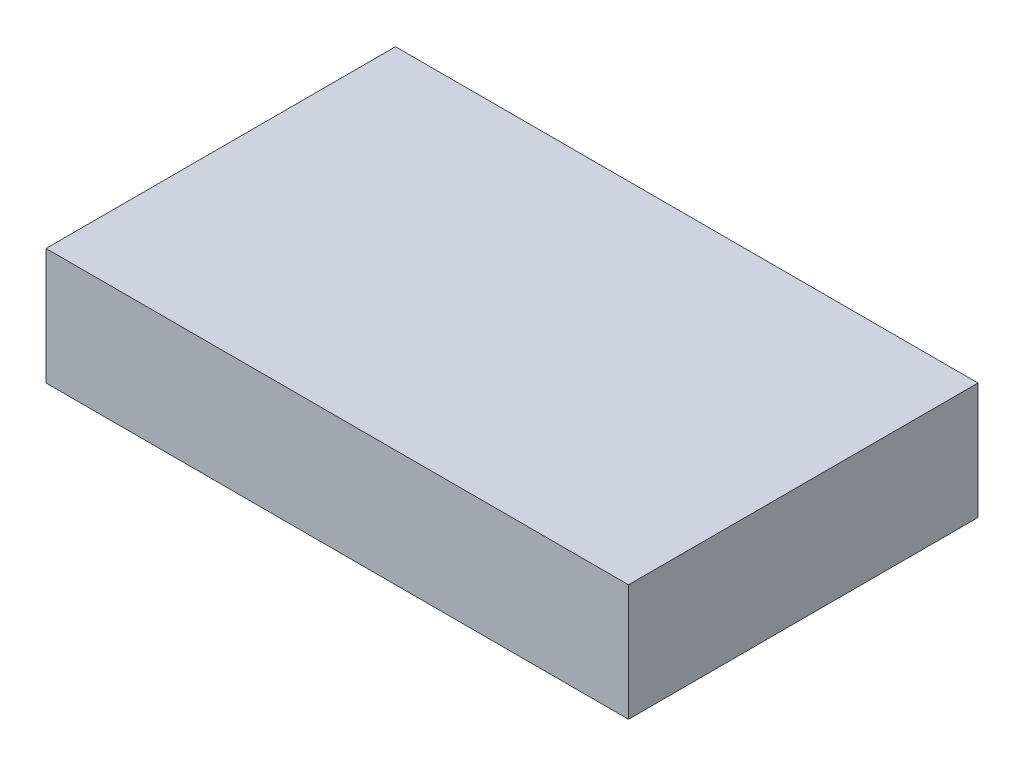
ISO-10303-21;
HEADER;
FILE_DESCRIPTION(('STEP AP214'),'2;1');
FILE_NAME('part.step','',(''),(''),'','','');
FILE_SCHEMA(('AUTOMOTIVE_DESIGN { 1 0 10303 214 1 1 1 1 }'));
ENDSEC;
DATA;
#1=APPLICATION_CONTEXT('core data for automotive mechanical design processes');
#2=APPLICATION_PROTOCOL_DEFINITION('international standard','automotive_design',2000,#1);
#3=PRODUCT_CONTEXT('',#1,'mechanical');
#4=PRODUCT('Part','Part','',(#3));
#5=PRODUCT_RELATED_PRODUCT_CATEGORY('part','',(#4));
#6=PRODUCT_DEFINITION_FORMATION('','',#4);
#7=PRODUCT_DEFINITION_CONTEXT('part definition',#1,'design');
#8=PRODUCT_DEFINITION('design','',#6,#7);
#9=PRODUCT_DEFINITION_SHAPE('','',#8);
#10=(LENGTH_UNIT() NAMED_UNIT(*) SI_UNIT(.MILLI.,.METRE.));
#11=(NAMED_UNIT(*) PLANE_ANGLE_UNIT() SI_UNIT($,.RADIAN.));
#12=(NAMED_UNIT(*) SI_UNIT($,.STERADIAN.) SOLID_ANGLE_UNIT());
#13=UNCERTAINTY_MEASURE_WITH_UNIT(LENGTH_MEASURE(1.E-05),#10,'distance_accuracy_value','');
#14=(GEOMETRIC_REPRESENTATION_CONTEXT(3) GLOBAL_UNCERTAINTY_ASSIGNED_CONTEXT((#13)) GLOBAL_UNIT_ASSIGNED_CONTEXT((#10,
#11,#12)) REPRESENTATION_CONTEXT('',''));
#15=CARTESIAN_POINT('',(0.,0.,0.));
#16=DIRECTION('',(0.,0.,1.));
#17=DIRECTION('',(1.,0.,0.));
#18=AXIS2_PLACEMENT_3D('',#15,#16,#17);
#19=CARTESIAN_POINT('',(0.,0.,57.15));
#20=DIRECTION('',(1.,0.,0.));
#21=DIRECTION('',(0.,0.,-1.));
#22=AXIS2_PLACEMENT_3D('',#19,#20,#21);
#23=PLANE('',#22);
#24=DIRECTION('',(0.,-1.,0.));
#25=VECTOR('',#24,1.);
#26=CARTESIAN_POINT('',(0.,0.,0.));
#27=LINE('',#26,#25);
#28=CARTESIAN_POINT('',(0.,19.05,0.));
#29=VERTEX_POINT('',#28);
#30=CARTESIAN_POINT('',(0.,0.,0.));
#31=VERTEX_POINT('',#30);
#32=EDGE_CURVE('E113',#29,#31,#27,.T.);
#33=ORIENTED_EDGE('',*,*,#32,.T.);
#34=DIRECTION('',(0.,0.,-1.));
#35=VECTOR('',#34,1.);
#36=CARTESIAN_POINT('',(0.,0.,57.15));
#37=LINE('',#36,#35);
#38=CARTESIAN_POINT('',(0.,0.,57.15));
#39=VERTEX_POINT('',#38);
#40=EDGE_CURVE('E11',#39,#31,#37,.T.);
#41=ORIENTED_EDGE('',*,*,#40,.F.);
#42=DIRECTION('',(0.,-1.,0.));
#43=VECTOR('',#42,1.);
#44=CARTESIAN_POINT('',(0.,0.,57.15));
#45=LINE('',#44,#43);
#46=CARTESIAN_POINT('',(0.,19.05,57.15));
#47=VERTEX_POINT('',#46);
#48=EDGE_CURVE('E97',#47,#39,#45,.T.);
#49=ORIENTED_EDGE('',*,*,#48,.F.);
#50=DIRECTION('',(0.,0.,-1.));
#51=VECTOR('',#50,1.);
#52=CARTESIAN_POINT('',(0.,19.05,57.15));
#53=LINE('',#52,#51);
#54=EDGE_CURVE('E109',#47,#29,#53,.T.);
#55=ORIENTED_EDGE('',*,*,#54,.T.);
#56=EDGE_LOOP('',(#33,#41,#49,#55));
#57=FACE_BOUND('',#56,.T.);
#58=ADVANCED_FACE('F45',(#57),#23,.F.);
#59=CARTESIAN_POINT('',(0.,0.,57.15));
#60=DIRECTION('',(0.,1.,0.));
#61=DIRECTION('',(0.,0.,1.));
#62=AXIS2_PLACEMENT_3D('',#59,#60,#61);
#63=PLANE('',#62);
#64=DIRECTION('',(1.,0.,0.));
#65=VECTOR('',#64,1.);
#66=CARTESIAN_POINT('',(0.,0.,0.));
#67=LINE('',#66,#65);
#68=CARTESIAN_POINT('',(95.25,0.,0.));
#69=VERTEX_POINT('',#68);
#70=EDGE_CURVE('E102',#31,#69,#67,.T.);
#71=ORIENTED_EDGE('',*,*,#70,.T.);
#72=DIRECTION('',(0.,0.,-1.));
#73=VECTOR('',#72,1.);
#74=CARTESIAN_POINT('',(95.25,0.,57.15));
#75=LINE('',#74,#73);
#76=CARTESIAN_POINT('',(95.25,0.,57.15));
#77=VERTEX_POINT('',#76);
#78=EDGE_CURVE('E54',#77,#69,#75,.T.);
#79=ORIENTED_EDGE('',*,*,#78,.F.);
#80=DIRECTION('',(1.,0.,0.));
#81=VECTOR('',#80,1.);
#82=CARTESIAN_POINT('',(0.,0.,57.15));
#83=LINE('',#82,#81);
#84=EDGE_CURVE('E92',#39,#77,#83,.T.);
#85=ORIENTED_EDGE('',*,*,#84,.F.);
#86=ORIENTED_EDGE('',*,*,#40,.T.);
#87=EDGE_LOOP('',(#71,#79,#85,#86));
#88=FACE_BOUND('',#87,.T.);
#89=ADVANCED_FACE('F101',(#88),#63,.F.);
#90=CARTESIAN_POINT('',(95.25,0.,57.15));
#91=DIRECTION('',(-1.,0.,0.));
#92=DIRECTION('',(0.,0.,1.));
#93=AXIS2_PLACEMENT_3D('',#90,#91,#92);
#94=PLANE('',#93);
#95=DIRECTION('',(0.,1.,0.));
#96=VECTOR('',#95,1.);
#97=CARTESIAN_POINT('',(95.25,0.,0.));
#98=LINE('',#97,#96);
#99=CARTESIAN_POINT('',(95.25,19.05,0.));
#100=VERTEX_POINT('',#99);
#101=EDGE_CURVE('E79',#69,#100,#98,.T.);
#102=ORIENTED_EDGE('',*,*,#101,.T.);
#103=DIRECTION('',(0.,0.,-1.));
#104=VECTOR('',#103,1.);
#105=CARTESIAN_POINT('',(95.25,19.05,57.15));
#106=LINE('',#105,#104);
#107=CARTESIAN_POINT('',(95.25,19.05,57.15));
#108=VERTEX_POINT('',#107);
#109=EDGE_CURVE('E104',#108,#100,#106,.T.);
#110=ORIENTED_EDGE('',*,*,#109,.F.);
#111=DIRECTION('',(0.,1.,0.));
#112=VECTOR('',#111,1.);
#113=CARTESIAN_POINT('',(95.25,0.,57.15));
#114=LINE('',#113,#112);
#115=EDGE_CURVE('E95',#77,#108,#114,.T.);
#116=ORIENTED_EDGE('',*,*,#115,.F.);
#117=ORIENTED_EDGE('',*,*,#78,.T.);
#118=EDGE_LOOP('',(#102,#110,#116,#117));
#119=FACE_BOUND('',#118,.T.);
#120=ADVANCED_FACE('F105',(#119),#94,.F.);
#121=CARTESIAN_POINT('',(0.,19.05,57.15));
#122=DIRECTION('',(0.,-1.,0.));
#123=DIRECTION('',(0.,0.,-1.));
#124=AXIS2_PLACEMENT_3D('',#121,#122,#123);
#125=PLANE('',#124);
#126=DIRECTION('',(-1.,0.,0.));
#127=VECTOR('',#126,1.);
#128=CARTESIAN_POINT('',(0.,19.05,0.));
#129=LINE('',#128,#127);
#130=EDGE_CURVE('E85',#100,#29,#129,.T.);
#131=ORIENTED_EDGE('',*,*,#130,.T.);
#132=ORIENTED_EDGE('',*,*,#54,.F.);
#133=DIRECTION('',(-1.,0.,0.));
#134=VECTOR('',#133,1.);
#135=CARTESIAN_POINT('',(0.,19.05,57.15));
#136=LINE('',#135,#134);
#137=EDGE_CURVE('E62',#108,#47,#136,.T.);
#138=ORIENTED_EDGE('',*,*,#137,.F.);
#139=ORIENTED_EDGE('',*,*,#109,.T.);
#140=EDGE_LOOP('',(#131,#132,#138,#139));
#141=FACE_BOUND('',#140,.T.);
#142=ADVANCED_FACE('F126',(#141),#125,.F.);
#143=CARTESIAN_POINT('',(0.,0.,57.15));
#144=DIRECTION('',(0.,0.,-1.));
#145=DIRECTION('',(-1.,0.,0.));
#146=AXIS2_PLACEMENT_3D('',#143,#144,#145);
#147=PLANE('',#146);
#148=ORIENTED_EDGE('',*,*,#48,.T.);
#149=ORIENTED_EDGE('',*,*,#84,.T.);
#150=ORIENTED_EDGE('',*,*,#115,.T.);
#151=ORIENTED_EDGE('',*,*,#137,.T.);
#152=EDGE_LOOP('',(#148,#149,#150,#151));
#153=FACE_BOUND('',#152,.T.);
#154=ADVANCED_FACE('F93',(#153),#147,.F.);
#155=CARTESIAN_POINT('',(0.,0.,0.));
#156=DIRECTION('',(0.,0.,-1.));
#157=DIRECTION('',(-1.,0.,0.));
#158=AXIS2_PLACEMENT_3D('',#155,#156,#157);
#159=PLANE('',#158);
#160=ORIENTED_EDGE('',*,*,#32,.F.);
#161=ORIENTED_EDGE('',*,*,#130,.F.);
#162=ORIENTED_EDGE('',*,*,#101,.F.);
#163=ORIENTED_EDGE('',*,*,#70,.F.);
#164=EDGE_LOOP('',(#160,#161,#162,#163));
#165=FACE_BOUND('',#164,.T.);
#166=ADVANCED_FACE('F129',(#165),#159,.T.);
#167=CLOSED_SHELL('',(#58,#89,#120,#142,#154,#166));
#168=MANIFOLD_SOLID_BREP('B2',#167);
#169=ADVANCED_BREP_SHAPE_REPRESENTATION('',(#18,#168),#14);
#170=SHAPE_DEFINITION_REPRESENTATION(#9,#169);
ENDSEC;
END-ISO-10303-21;
